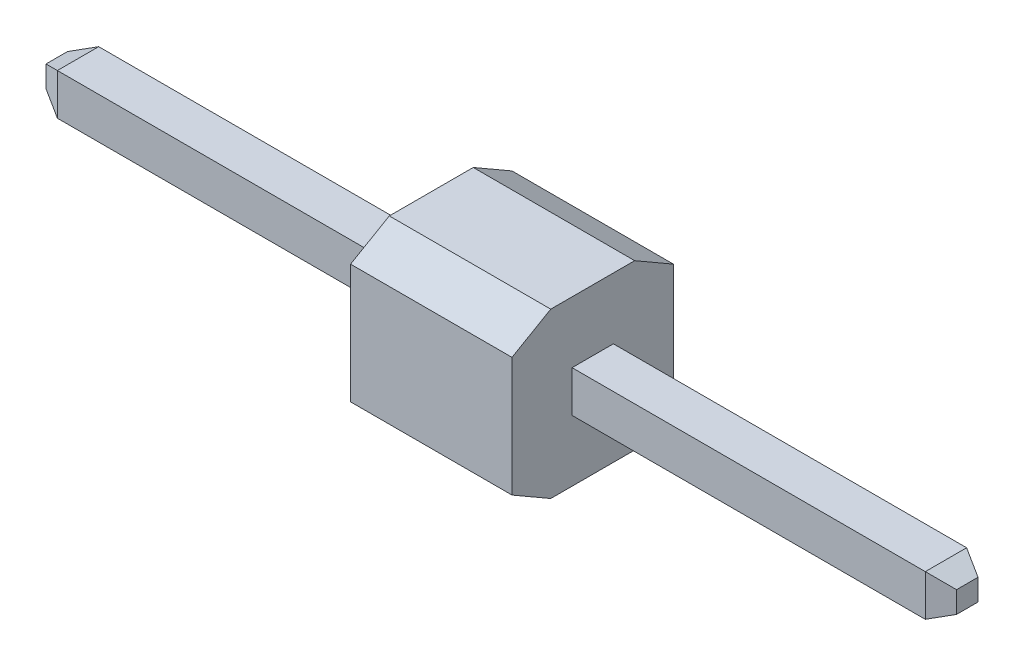
ISO-10303-21;
HEADER;
FILE_DESCRIPTION(('STEP AP214'),'2;1');
FILE_NAME('part.step','',(''),(''),'','','');
FILE_SCHEMA(('AUTOMOTIVE_DESIGN { 1 0 10303 214 1 1 1 1 }'));
ENDSEC;
DATA;
#1=APPLICATION_CONTEXT('core data for automotive mechanical design processes');
#2=APPLICATION_PROTOCOL_DEFINITION('international standard','automotive_design',2000,#1);
#3=PRODUCT_CONTEXT('',#1,'mechanical');
#4=PRODUCT('Part','Part','',(#3));
#5=PRODUCT_RELATED_PRODUCT_CATEGORY('part','',(#4));
#6=PRODUCT_DEFINITION_FORMATION('','',#4);
#7=PRODUCT_DEFINITION_CONTEXT('part definition',#1,'design');
#8=PRODUCT_DEFINITION('design','',#6,#7);
#9=PRODUCT_DEFINITION_SHAPE('','',#8);
#10=(LENGTH_UNIT() NAMED_UNIT(*) SI_UNIT(.MILLI.,.METRE.));
#11=(NAMED_UNIT(*) PLANE_ANGLE_UNIT() SI_UNIT($,.RADIAN.));
#12=(NAMED_UNIT(*) SI_UNIT($,.STERADIAN.) SOLID_ANGLE_UNIT());
#13=UNCERTAINTY_MEASURE_WITH_UNIT(LENGTH_MEASURE(1.E-05),#10,'distance_accuracy_value','');
#14=(GEOMETRIC_REPRESENTATION_CONTEXT(3) GLOBAL_UNCERTAINTY_ASSIGNED_CONTEXT((#13)) GLOBAL_UNIT_ASSIGNED_CONTEXT((#10,
#11,#12)) REPRESENTATION_CONTEXT('',''));
#15=CARTESIAN_POINT('',(0.,0.,0.));
#16=DIRECTION('',(0.,0.,1.));
#17=DIRECTION('',(1.,0.,0.));
#18=AXIS2_PLACEMENT_3D('',#15,#16,#17);
#19=CARTESIAN_POINT('',(5.42109969062971,-7.30288427394286,-2.77111992940321));
#20=DIRECTION('',(1.,-9.93476518829084E-08,4.37113882867379E-08));
#21=DIRECTION('',(-9.93476589883358E-08,-1.,8.74227765734759E-08));
#22=AXIS2_PLACEMENT_3D('',#19,#20,#21);
#23=PLANE('',#22);
#24=DIRECTION('',(-1.18186619959243E-08,-0.500000075710538,-0.866025360072935));
#25=VECTOR('',#24,1.);
#26=CARTESIAN_POINT('',(5.4210994984551,-8.54647397517509,-1.20111982068513));
#27=LINE('',#26,#25);
#28=CARTESIAN_POINT('',(5.4210994984551,-8.54647397517509,-1.20111982068513));
#29=VERTEX_POINT('',#28);
#30=CARTESIAN_POINT('',(5.42109949026689,-8.89288418914276,-1.80111979040099));
#31=VERTEX_POINT('',#30);
#32=EDGE_CURVE('E11',#29,#31,#27,.T.);
#33=ORIENTED_EDGE('',*,*,#32,.T.);
#34=DIRECTION('',(4.37113811813104E-08,-8.74227842254741E-08,-0.999999999999995));
#35=VECTOR('',#34,1.);
#36=CARTESIAN_POINT('',(5.42109949026689,-8.89288418914276,-1.80111979040099));
#37=LINE('',#36,#35);
#38=CARTESIAN_POINT('',(5.42109954709169,-8.89288430279238,-3.10111979040099));
#39=VERTEX_POINT('',#38);
#40=EDGE_CURVE('E304',#31,#39,#37,.T.);
#41=ORIENTED_EDGE('',*,*,#40,.T.);
#42=DIRECTION('',(8.75289950709516E-08,0.499999924289837,-0.866025447495713));
#43=VECTOR('',#42,1.);
#44=CARTESIAN_POINT('',(5.42109954709169,-8.89288430279238,-3.10111979040099));
#45=LINE('',#44,#43);
#46=CARTESIAN_POINT('',(5.42109960773356,-8.54647419373205,-3.70111982068513));
#47=VERTEX_POINT('',#46);
#48=EDGE_CURVE('E296',#39,#47,#45,.T.);
#49=ORIENTED_EDGE('',*,*,#48,.T.);
#50=DIRECTION('',(9.93476593243697E-08,0.999999999999991,-8.74227764821842E-08));
#51=VECTOR('',#50,1.);
#52=CARTESIAN_POINT('',(5.42109960773356,-8.54647419373205,-3.70111982068513));
#53=LINE('',#52,#51);
#54=CARTESIAN_POINT('',(5.42109979124653,-6.69929451676005,-3.70111998217071));
#55=VERTEX_POINT('',#54);
#56=EDGE_CURVE('E281',#47,#55,#53,.T.);
#57=ORIENTED_EDGE('',*,*,#56,.T.);
#58=DIRECTION('',(-1.18186632778994E-08,-0.500000075710539,-0.866025360072934));
#59=VECTOR('',#58,1.);
#60=CARTESIAN_POINT('',(5.42109979943474,-6.35288430279238,-3.10112001245485));
#61=LINE('',#60,#59);
#62=CARTESIAN_POINT('',(5.42109979943474,-6.35288430279238,-3.10112001245485));
#63=VERTEX_POINT('',#62);
#64=EDGE_CURVE('E265',#63,#55,#61,.T.);
#65=ORIENTED_EDGE('',*,*,#64,.F.);
#66=DIRECTION('',(4.37113811813104E-08,-8.74227835422599E-08,-0.999999999999995));
#67=VECTOR('',#66,1.);
#68=CARTESIAN_POINT('',(5.42109974260995,-6.35288418914276,-1.80112001245485));
#69=LINE('',#68,#67);
#70=CARTESIAN_POINT('',(5.42109974260995,-6.35288418914276,-1.80112001245485));
#71=VERTEX_POINT('',#70);
#72=EDGE_CURVE('E248',#71,#63,#69,.T.);
#73=ORIENTED_EDGE('',*,*,#72,.F.);
#74=DIRECTION('',(8.75289963529268E-08,0.499999924289837,-0.866025447495713));
#75=VECTOR('',#74,1.);
#76=CARTESIAN_POINT('',(5.42109968196808,-6.69929429820309,-1.20111998217071));
#77=LINE('',#76,#75);
#78=CARTESIAN_POINT('',(5.42109968196808,-6.69929429820309,-1.20111998217071));
#79=VERTEX_POINT('',#78);
#80=EDGE_CURVE('E242',#79,#71,#77,.T.);
#81=ORIENTED_EDGE('',*,*,#80,.F.);
#82=DIRECTION('',(9.93476593243697E-08,0.999999999999991,-8.74227763619768E-08));
#83=VECTOR('',#82,1.);
#84=CARTESIAN_POINT('',(5.4210994984551,-8.54647397517509,-1.20111982068513));
#85=LINE('',#84,#83);
#86=EDGE_CURVE('E236',#29,#79,#85,.T.);
#87=ORIENTED_EDGE('',*,*,#86,.F.);
#88=EDGE_LOOP('',(#33,#41,#49,#57,#65,#73,#81,#87));
#89=FACE_BOUND('',#88,.T.);
#90=DIRECTION('',(-4.37113817364219E-08,8.74227842895255E-08,0.999999999999995));
#91=VECTOR('',#90,1.);
#92=CARTESIAN_POINT('',(5.42109962704721,-7.94288427394286,-2.77111987345263));
#93=LINE('',#92,#91);
#94=CARTESIAN_POINT('',(5.42109962704721,-7.94288427394286,-2.77111987345263));
#95=VERTEX_POINT('',#94);
#96=CARTESIAN_POINT('',(5.42109959907193,-7.94288421799228,-2.13111987345263));
#97=VERTEX_POINT('',#96);
#98=EDGE_CURVE('E302',#95,#97,#93,.T.);
#99=ORIENTED_EDGE('',*,*,#98,.T.);
#100=DIRECTION('',(-9.93476592658907E-08,-0.999999999999991,8.74227759628525E-08));
#101=VECTOR('',#100,1.);
#102=CARTESIAN_POINT('',(5.42109966265443,-7.30288421799228,-2.13111992940321));
#103=LINE('',#102,#101);
#104=CARTESIAN_POINT('',(5.42109966265443,-7.30288421799228,-2.13111992940321));
#105=VERTEX_POINT('',#104);
#106=EDGE_CURVE('E293',#105,#97,#103,.T.);
#107=ORIENTED_EDGE('',*,*,#106,.F.);
#108=DIRECTION('',(-4.37113817364219E-08,8.74227842895254E-08,0.999999999999995));
#109=VECTOR('',#108,1.);
#110=CARTESIAN_POINT('',(5.42109969062971,-7.30288427394286,-2.77111992940321));
#111=LINE('',#110,#109);
#112=CARTESIAN_POINT('',(5.42109969062971,-7.30288427394286,-2.77111992940321));
#113=VERTEX_POINT('',#112);
#114=EDGE_CURVE('E278',#113,#105,#111,.T.);
#115=ORIENTED_EDGE('',*,*,#114,.F.);
#116=DIRECTION('',(-9.93476592658907E-08,-0.999999999999991,8.74227766567419E-08));
#117=VECTOR('',#116,1.);
#118=CARTESIAN_POINT('',(5.42109969062971,-7.30288427394286,-2.77111992940321));
#119=LINE('',#118,#117);
#120=EDGE_CURVE('E263',#113,#95,#119,.T.);
#121=ORIENTED_EDGE('',*,*,#120,.T.);
#122=EDGE_LOOP('',(#99,#107,#115,#121));
#123=FACE_BOUND('',#122,.T.);
#124=ADVANCED_FACE('F17',(#89,#123),#23,.T.);
#125=CARTESIAN_POINT('',(2.92109969062971,-7.30288402557373,-2.77112003868168));
#126=DIRECTION('',(1.,-9.93476518829084E-08,4.37113882867379E-08));
#127=DIRECTION('',(-9.93476589883358E-08,-1.,8.74227765734759E-08));
#128=AXIS2_PLACEMENT_3D('',#125,#126,#127);
#129=PLANE('',#128);
#130=DIRECTION('',(-1.18186626369119E-08,-0.500000075710538,-0.866025360072935));
#131=VECTOR('',#130,1.);
#132=CARTESIAN_POINT('',(2.9210994984551,-8.54647372680596,-1.2011199299636));
#133=LINE('',#132,#131);
#134=CARTESIAN_POINT('',(2.9210994984551,-8.54647372680596,-1.2011199299636));
#135=VERTEX_POINT('',#134);
#136=CARTESIAN_POINT('',(2.92109949026689,-8.89288394077363,-1.80111989967946));
#137=VERTEX_POINT('',#136);
#138=EDGE_CURVE('E24',#135,#137,#133,.T.);
#139=ORIENTED_EDGE('',*,*,#138,.F.);
#140=DIRECTION('',(9.9347659083955E-08,0.999999999999991,-8.74227763619768E-08));
#141=VECTOR('',#140,1.);
#142=CARTESIAN_POINT('',(2.9210994984551,-8.54647372680596,-1.2011199299636));
#143=LINE('',#142,#141);
#144=CARTESIAN_POINT('',(2.92109968196808,-6.69929404983396,-1.20112009144918));
#145=VERTEX_POINT('',#144);
#146=EDGE_CURVE('E300',#135,#145,#143,.T.);
#147=ORIENTED_EDGE('',*,*,#146,.T.);
#148=DIRECTION('',(8.75289963529268E-08,0.499999924289837,-0.866025447495713));
#149=VECTOR('',#148,1.);
#150=CARTESIAN_POINT('',(2.92109968196808,-6.69929404983396,-1.20112009144918));
#151=LINE('',#150,#149);
#152=CARTESIAN_POINT('',(2.92109974260995,-6.35288394077363,-1.80112012173332));
#153=VERTEX_POINT('',#152);
#154=EDGE_CURVE('E286',#145,#153,#151,.T.);
#155=ORIENTED_EDGE('',*,*,#154,.T.);
#156=DIRECTION('',(4.37113811813104E-08,-8.74227835422599E-08,-0.999999999999995));
#157=VECTOR('',#156,1.);
#158=CARTESIAN_POINT('',(2.92109974260995,-6.35288394077363,-1.80112012173332));
#159=LINE('',#158,#157);
#160=CARTESIAN_POINT('',(2.92109979943474,-6.35288405442325,-3.10112012173332));
#161=VERTEX_POINT('',#160);
#162=EDGE_CURVE('E271',#153,#161,#159,.T.);
#163=ORIENTED_EDGE('',*,*,#162,.T.);
#164=DIRECTION('',(-1.18186632778994E-08,-0.500000075710539,-0.866025360072934));
#165=VECTOR('',#164,1.);
#166=CARTESIAN_POINT('',(2.92109979943474,-6.35288405442325,-3.10112012173332));
#167=LINE('',#166,#165);
#168=CARTESIAN_POINT('',(2.92109979124653,-6.69929426839092,-3.70112009144918));
#169=VERTEX_POINT('',#168);
#170=EDGE_CURVE('E253',#161,#169,#167,.T.);
#171=ORIENTED_EDGE('',*,*,#170,.T.);
#172=DIRECTION('',(9.9347659083955E-08,0.999999999999991,-8.74227764821842E-08));
#173=VECTOR('',#172,1.);
#174=CARTESIAN_POINT('',(2.92109960773356,-8.54647394536292,-3.7011199299636));
#175=LINE('',#174,#173);
#176=CARTESIAN_POINT('',(2.92109960773356,-8.54647394536292,-3.7011199299636));
#177=VERTEX_POINT('',#176);
#178=EDGE_CURVE('E261',#177,#169,#175,.T.);
#179=ORIENTED_EDGE('',*,*,#178,.F.);
#180=DIRECTION('',(8.75289957119392E-08,0.499999924289837,-0.866025447495713));
#181=VECTOR('',#180,1.);
#182=CARTESIAN_POINT('',(2.92109954709169,-8.89288405442325,-3.10111989967946));
#183=LINE('',#182,#181);
#184=CARTESIAN_POINT('',(2.92109954709169,-8.89288405442325,-3.10111989967946));
#185=VERTEX_POINT('',#184);
#186=EDGE_CURVE('E276',#185,#177,#183,.T.);
#187=ORIENTED_EDGE('',*,*,#186,.F.);
#188=DIRECTION('',(4.37113811813104E-08,-8.74227842254741E-08,-0.999999999999995));
#189=VECTOR('',#188,1.);
#190=CARTESIAN_POINT('',(2.92109949026689,-8.89288394077363,-1.80111989967946));
#191=LINE('',#190,#189);
#192=EDGE_CURVE('E291',#137,#185,#191,.T.);
#193=ORIENTED_EDGE('',*,*,#192,.F.);
#194=EDGE_LOOP('',(#139,#147,#155,#163,#171,#179,#187,#193));
#195=FACE_BOUND('',#194,.T.);
#196=DIRECTION('',(-9.93476592658907E-08,-0.999999999999991,8.74227759628525E-08));
#197=VECTOR('',#196,1.);
#198=CARTESIAN_POINT('',(2.92109966265443,-7.30288396962315,-2.13112003868168));
#199=LINE('',#198,#197);
#200=CARTESIAN_POINT('',(2.92109966265443,-7.30288396962315,-2.13112003868168));
#201=VERTEX_POINT('',#200);
#202=CARTESIAN_POINT('',(2.92109959907193,-7.94288396962315,-2.1311199827311));
#203=VERTEX_POINT('',#202);
#204=EDGE_CURVE('E298',#201,#203,#199,.T.);
#205=ORIENTED_EDGE('',*,*,#204,.T.);
#206=DIRECTION('',(-4.37113817364219E-08,8.74227842895255E-08,0.999999999999995));
#207=VECTOR('',#206,1.);
#208=CARTESIAN_POINT('',(2.92109962704721,-7.94288402557373,-2.7711199827311));
#209=LINE('',#208,#207);
#210=CARTESIAN_POINT('',(2.92109962704721,-7.94288402557373,-2.7711199827311));
#211=VERTEX_POINT('',#210);
#212=EDGE_CURVE('E283',#211,#203,#209,.T.);
#213=ORIENTED_EDGE('',*,*,#212,.F.);
#214=DIRECTION('',(-9.93476585720013E-08,-0.999999999999991,8.74227766567419E-08));
#215=VECTOR('',#214,1.);
#216=CARTESIAN_POINT('',(2.92109969062971,-7.30288402557373,-2.77112003868168));
#217=LINE('',#216,#215);
#218=CARTESIAN_POINT('',(2.92109969062971,-7.30288402557373,-2.77112003868168));
#219=VERTEX_POINT('',#218);
#220=EDGE_CURVE('E268',#219,#211,#217,.T.);
#221=ORIENTED_EDGE('',*,*,#220,.F.);
#222=DIRECTION('',(-4.37113810425325E-08,8.74227842895254E-08,0.999999999999995));
#223=VECTOR('',#222,1.);
#224=CARTESIAN_POINT('',(2.92109969062971,-7.30288402557373,-2.77112003868168));
#225=LINE('',#224,#223);
#226=EDGE_CURVE('E251',#219,#201,#225,.T.);
#227=ORIENTED_EDGE('',*,*,#226,.T.);
#228=EDGE_LOOP('',(#205,#213,#221,#227));
#229=FACE_BOUND('',#228,.T.);
#230=ADVANCED_FACE('F314',(#195,#229),#129,.F.);
#231=CARTESIAN_POINT('',(5.4210994984551,-8.54647397517509,-1.20111982068513));
#232=DIRECTION('',(1.07893287081065E-07,0.866025360072937,-0.500000075710535));
#233=DIRECTION('',(1.18186629566715E-08,0.500000075710542,0.866025360072941));
#234=AXIS2_PLACEMENT_3D('',#231,#232,#233);
#235=PLANE('',#234);
#236=ORIENTED_EDGE('',*,*,#138,.T.);
#237=DIRECTION('',(-0.999999999999994,9.93476518829078E-08,-4.37113883755555E-08));
#238=VECTOR('',#237,1.);
#239=CARTESIAN_POINT('',(5.42109949026689,-8.89288418914276,-1.80111979040099));
#240=LINE('',#239,#238);
#241=EDGE_CURVE('E288',#31,#137,#240,.T.);
#242=ORIENTED_EDGE('',*,*,#241,.F.);
#243=ORIENTED_EDGE('',*,*,#32,.F.);
#244=DIRECTION('',(-0.999999999999994,9.93476518829078E-08,-4.3711388109102E-08));
#245=VECTOR('',#244,1.);
#246=CARTESIAN_POINT('',(5.4210994984551,-8.54647397517509,-1.20111982068513));
#247=LINE('',#246,#245);
#248=EDGE_CURVE('E256',#29,#135,#247,.T.);
#249=ORIENTED_EDGE('',*,*,#248,.T.);
#250=EDGE_LOOP('',(#236,#242,#243,#249));
#251=FACE_BOUND('',#250,.T.);
#252=ADVANCED_FACE('F306',(#251),#235,.F.);
#253=CARTESIAN_POINT('',(5.42109949026689,-8.89288418914276,-1.80111979040099));
#254=DIRECTION('',(9.93476589883358E-08,1.,-8.74227765734759E-08));
#255=DIRECTION('',(1.,-9.93476518829084E-08,4.37113882867379E-08));
#256=AXIS2_PLACEMENT_3D('',#253,#254,#255);
#257=PLANE('',#256);
#258=ORIENTED_EDGE('',*,*,#192,.T.);
#259=DIRECTION('',(-0.999999999999994,9.93476518829078E-08,-4.37113882867377E-08));
#260=VECTOR('',#259,1.);
#261=CARTESIAN_POINT('',(5.42109954709169,-8.89288430279238,-3.10111979040099));
#262=LINE('',#261,#260);
#263=EDGE_CURVE('E273',#39,#185,#262,.T.);
#264=ORIENTED_EDGE('',*,*,#263,.F.);
#265=ORIENTED_EDGE('',*,*,#40,.F.);
#266=ORIENTED_EDGE('',*,*,#241,.T.);
#267=EDGE_LOOP('',(#258,#264,#265,#266));
#268=FACE_BOUND('',#267,.T.);
#269=ADVANCED_FACE('F311',(#268),#257,.F.);
#270=CARTESIAN_POINT('',(5.42109954709169,-8.89288430279238,-3.10111979040099));
#271=DIRECTION('',(6.41819058997377E-08,0.866025447495721,0.499999924289845));
#272=DIRECTION('',(-8.7528996031702E-08,-0.499999924289838,0.866025447495717));
#273=AXIS2_PLACEMENT_3D('',#270,#271,#272);
#274=PLANE('',#273);
#275=ORIENTED_EDGE('',*,*,#186,.T.);
#276=DIRECTION('',(-0.999999999999994,9.93476518829078E-08,-4.37113882867377E-08));
#277=VECTOR('',#276,1.);
#278=CARTESIAN_POINT('',(5.42109960773356,-8.54647419373205,-3.70111982068513));
#279=LINE('',#278,#277);
#280=EDGE_CURVE('E258',#47,#177,#279,.T.);
#281=ORIENTED_EDGE('',*,*,#280,.F.);
#282=ORIENTED_EDGE('',*,*,#48,.F.);
#283=ORIENTED_EDGE('',*,*,#263,.T.);
#284=EDGE_LOOP('',(#275,#281,#282,#283));
#285=FACE_BOUND('',#284,.T.);
#286=ADVANCED_FACE('F319',(#285),#274,.F.);
#287=CARTESIAN_POINT('',(5.42109960773356,-8.54647419373205,-3.70111982068513));
#288=DIRECTION('',(-4.37113811813106E-08,8.74227836789032E-08,1.));
#289=DIRECTION('',(-1.,9.93476518829084E-08,-4.37113882867379E-08));
#290=AXIS2_PLACEMENT_3D('',#287,#288,#289);
#291=PLANE('',#290);
#292=ORIENTED_EDGE('',*,*,#178,.T.);
#293=DIRECTION('',(-0.999999999999994,9.93476518829078E-08,-4.37113882867377E-08));
#294=VECTOR('',#293,1.);
#295=CARTESIAN_POINT('',(5.42109979124653,-6.69929451676005,-3.70111998217071));
#296=LINE('',#295,#294);
#297=EDGE_CURVE('E245',#55,#169,#296,.T.);
#298=ORIENTED_EDGE('',*,*,#297,.F.);
#299=ORIENTED_EDGE('',*,*,#56,.F.);
#300=ORIENTED_EDGE('',*,*,#280,.T.);
#301=EDGE_LOOP('',(#292,#298,#299,#300));
#302=FACE_BOUND('',#301,.T.);
#303=ADVANCED_FACE('F326',(#302),#291,.F.);
#304=CARTESIAN_POINT('',(5.42109979943474,-6.35288430279238,-3.10112001245485));
#305=DIRECTION('',(1.07893287081065E-07,0.866025360072937,-0.500000075710535));
#306=DIRECTION('',(1.18186629566715E-08,0.500000075710542,0.866025360072941));
#307=AXIS2_PLACEMENT_3D('',#304,#305,#306);
#308=PLANE('',#307);
#309=ORIENTED_EDGE('',*,*,#170,.F.);
#310=DIRECTION('',(-0.999999999999994,9.93476522381792E-08,-4.37113882867377E-08));
#311=VECTOR('',#310,1.);
#312=CARTESIAN_POINT('',(5.42109979943474,-6.35288430279238,-3.10112001245485));
#313=LINE('',#312,#311);
#314=EDGE_CURVE('E239',#63,#161,#313,.T.);
#315=ORIENTED_EDGE('',*,*,#314,.F.);
#316=ORIENTED_EDGE('',*,*,#64,.T.);
#317=ORIENTED_EDGE('',*,*,#297,.T.);
#318=EDGE_LOOP('',(#309,#315,#316,#317));
#319=FACE_BOUND('',#318,.T.);
#320=ADVANCED_FACE('F329',(#319),#308,.T.);
#321=CARTESIAN_POINT('',(5.42109974260995,-6.35288418914276,-1.80112001245485));
#322=DIRECTION('',(9.93476589883358E-08,1.,-8.74227765734759E-08));
#323=DIRECTION('',(1.,-9.93476518829084E-08,4.37113882867379E-08));
#324=AXIS2_PLACEMENT_3D('',#321,#322,#323);
#325=PLANE('',#324);
#326=ORIENTED_EDGE('',*,*,#162,.F.);
#327=DIRECTION('',(-0.999999999999994,9.93476522381792E-08,-4.37113884643734E-08));
#328=VECTOR('',#327,1.);
#329=CARTESIAN_POINT('',(5.42109974260995,-6.35288418914276,-1.80112001245485));
#330=LINE('',#329,#328);
#331=EDGE_CURVE('E233',#71,#153,#330,.T.);
#332=ORIENTED_EDGE('',*,*,#331,.F.);
#333=ORIENTED_EDGE('',*,*,#72,.T.);
#334=ORIENTED_EDGE('',*,*,#314,.T.);
#335=EDGE_LOOP('',(#326,#332,#333,#334));
#336=FACE_BOUND('',#335,.T.);
#337=ADVANCED_FACE('F333',(#336),#325,.T.);
#338=CARTESIAN_POINT('',(5.42109968196808,-6.69929429820309,-1.20111998217071));
#339=DIRECTION('',(6.41819058997377E-08,0.866025447495721,0.499999924289845));
#340=DIRECTION('',(-8.7528996031702E-08,-0.499999924289838,0.866025447495717));
#341=AXIS2_PLACEMENT_3D('',#338,#339,#340);
#342=PLANE('',#341);
#343=ORIENTED_EDGE('',*,*,#154,.F.);
#344=DIRECTION('',(-0.999999999999994,9.93476518829078E-08,-4.3711388109102E-08));
#345=VECTOR('',#344,1.);
#346=CARTESIAN_POINT('',(5.42109968196808,-6.69929429820309,-1.20111998217071));
#347=LINE('',#346,#345);
#348=EDGE_CURVE('E230',#79,#145,#347,.T.);
#349=ORIENTED_EDGE('',*,*,#348,.F.);
#350=ORIENTED_EDGE('',*,*,#80,.T.);
#351=ORIENTED_EDGE('',*,*,#331,.T.);
#352=EDGE_LOOP('',(#343,#349,#350,#351));
#353=FACE_BOUND('',#352,.T.);
#354=ADVANCED_FACE('F337',(#353),#342,.T.);
#355=CARTESIAN_POINT('',(5.4210994984551,-8.54647397517509,-1.20111982068513));
#356=DIRECTION('',(-4.37113811813106E-08,8.74227835615132E-08,1.));
#357=DIRECTION('',(-9.93476589883358E-08,-1.,8.74227764560859E-08));
#358=AXIS2_PLACEMENT_3D('',#355,#356,#357);
#359=PLANE('',#358);
#360=ORIENTED_EDGE('',*,*,#146,.F.);
#361=ORIENTED_EDGE('',*,*,#248,.F.);
#362=ORIENTED_EDGE('',*,*,#86,.T.);
#363=ORIENTED_EDGE('',*,*,#348,.T.);
#364=EDGE_LOOP('',(#360,#361,#362,#363));
#365=FACE_BOUND('',#364,.T.);
#366=ADVANCED_FACE('F339',(#365),#359,.T.);
#367=CARTESIAN_POINT('',(-2.87890030937029,-7.30288344935735,-2.77112029220773));
#368=DIRECTION('',(-1.,9.93476518829084E-08,-4.37113882867379E-08));
#369=DIRECTION('',(9.93476589883358E-08,1.,-8.74227765734759E-08));
#370=AXIS2_PLACEMENT_3D('',#367,#368,#369);
#371=PLANE('',#370);
#372=DIRECTION('',(9.93476581453995E-08,0.999999999999991,-8.74227774760709E-08));
#373=VECTOR('',#372,1.);
#374=CARTESIAN_POINT('',(-2.87890037891393,-7.78900187966852,-2.2850017769009));
#375=LINE('',#374,#373);
#376=CARTESIAN_POINT('',(-2.87890037891393,-7.78900187966852,-2.2850017769009));
#377=VERTEX_POINT('',#376);
#378=CARTESIAN_POINT('',(-2.87890034590697,-7.45676493405052,-2.28500180594598));
#379=VERTEX_POINT('',#378);
#380=EDGE_CURVE('E228',#377,#379,#375,.T.);
#381=ORIENTED_EDGE('',*,*,#380,.T.);
#382=DIRECTION('',(4.37113793813867E-08,-8.74227801493995E-08,-0.999999999999995));
#383=VECTOR('',#382,1.);
#384=CARTESIAN_POINT('',(-2.87890034590697,-7.45676493405052,-2.28500180594598));
#385=LINE('',#384,#383);
#386=CARTESIAN_POINT('',(-2.87890033138443,-7.4567649630956,-2.61723875156398));
#387=VERTEX_POINT('',#386);
#388=EDGE_CURVE('E223',#379,#387,#385,.T.);
#389=ORIENTED_EDGE('',*,*,#388,.T.);
#390=DIRECTION('',(-9.93476608187277E-08,-0.999999999999991,8.74227761394067E-08));
#391=VECTOR('',#390,1.);
#392=CARTESIAN_POINT('',(-2.87890033138443,-7.4567649630956,-2.61723875156398));
#393=LINE('',#392,#391);
#394=CARTESIAN_POINT('',(-2.8789003643914,-7.7890019087136,-2.6172387225189));
#395=VERTEX_POINT('',#394);
#396=EDGE_CURVE('E215',#387,#395,#393,.T.);
#397=ORIENTED_EDGE('',*,*,#396,.T.);
#398=DIRECTION('',(-4.37113767080584E-08,8.74227828227278E-08,0.999999999999995));
#399=VECTOR('',#398,1.);
#400=CARTESIAN_POINT('',(-2.8789003643914,-7.7890019087136,-2.6172387225189));
#401=LINE('',#400,#399);
#402=EDGE_CURVE('E207',#395,#377,#401,.T.);
#403=ORIENTED_EDGE('',*,*,#402,.T.);
#404=EDGE_LOOP('',(#381,#389,#397,#403));
#405=FACE_BOUND('',#404,.T.);
#406=ADVANCED_FACE('F341',(#405),#371,.T.);
#407=CARTESIAN_POINT('',(-2.87890030937029,-7.30288344935735,-2.77112029220773));
#408=DIRECTION('',(9.93476589883358E-08,1.,-8.74227764510112E-08));
#409=DIRECTION('',(-4.37113811813106E-08,8.74227835564385E-08,1.));
#410=AXIS2_PLACEMENT_3D('',#407,#408,#409);
#411=PLANE('',#410);
#412=DIRECTION('',(0.999999999999994,-9.93476522661073E-08,4.37113882769953E-08));
#413=VECTOR('',#412,1.);
#414=CARTESIAN_POINT('',(-2.54890030937029,-7.30288348214207,-2.77112027778297));
#415=LINE('',#414,#413);
#416=CARTESIAN_POINT('',(-2.54890030937029,-7.30288348214207,-2.77112027778297));
#417=VERTEX_POINT('',#416);
#418=EDGE_CURVE('E225',#417,#219,#415,.T.);
#419=ORIENTED_EDGE('',*,*,#418,.F.);
#420=DIRECTION('',(-4.37113817364219E-08,8.74227842895255E-08,0.999999999999995));
#421=VECTOR('',#420,1.);
#422=CARTESIAN_POINT('',(-2.54890030937029,-7.30288348214207,-2.77112027778297));
#423=LINE('',#422,#421);
#424=CARTESIAN_POINT('',(-2.54890033734557,-7.30288342619149,-2.13112027778297));
#425=VERTEX_POINT('',#424);
#426=EDGE_CURVE('E217',#417,#425,#423,.T.);
#427=ORIENTED_EDGE('',*,*,#426,.T.);
#428=DIRECTION('',(0.999999999999994,-9.93476522661073E-08,4.37113882769953E-08));
#429=VECTOR('',#428,1.);
#430=CARTESIAN_POINT('',(-2.54890033734557,-7.30288342619149,-2.13112027778297));
#431=LINE('',#430,#429);
#432=EDGE_CURVE('E220',#425,#201,#431,.T.);
#433=ORIENTED_EDGE('',*,*,#432,.T.);
#434=ORIENTED_EDGE('',*,*,#226,.F.);
#435=EDGE_LOOP('',(#419,#427,#433,#434));
#436=FACE_BOUND('',#435,.T.);
#437=ADVANCED_FACE('F348',(#436),#411,.T.);
#438=CARTESIAN_POINT('',(-2.87890033734557,-7.30288339340677,-2.13112029220773));
#439=DIRECTION('',(-4.37113811813106E-08,8.74227836789032E-08,1.));
#440=DIRECTION('',(-1.,9.93476518829084E-08,-4.37113882867379E-08));
#441=AXIS2_PLACEMENT_3D('',#438,#439,#440);
#442=PLANE('',#441);
#443=ORIENTED_EDGE('',*,*,#432,.F.);
#444=DIRECTION('',(-9.93476592658907E-08,-0.999999999999991,8.74227766567419E-08));
#445=VECTOR('',#444,1.);
#446=CARTESIAN_POINT('',(-2.54890033734557,-7.30288342619149,-2.13112027778297));
#447=LINE('',#446,#445);
#448=CARTESIAN_POINT('',(-2.54890040092807,-7.94288342619149,-2.1311202218324));
#449=VERTEX_POINT('',#448);
#450=EDGE_CURVE('E209',#425,#449,#447,.T.);
#451=ORIENTED_EDGE('',*,*,#450,.T.);
#452=DIRECTION('',(0.999999999999994,-9.93476517789893E-08,4.37113882769953E-08));
#453=VECTOR('',#452,1.);
#454=CARTESIAN_POINT('',(-2.54890040092807,-7.94288342619149,-2.1311202218324));
#455=LINE('',#454,#453);
#456=EDGE_CURVE('E212',#449,#203,#455,.T.);
#457=ORIENTED_EDGE('',*,*,#456,.T.);
#458=ORIENTED_EDGE('',*,*,#204,.F.);
#459=EDGE_LOOP('',(#443,#451,#457,#458));
#460=FACE_BOUND('',#459,.T.);
#461=ADVANCED_FACE('F424',(#460),#442,.T.);
#462=CARTESIAN_POINT('',(-2.87890037295279,-7.94288344935735,-2.77112023625715));
#463=DIRECTION('',(9.93476589883357E-08,1.,-8.74227764040693E-08));
#464=DIRECTION('',(-4.37113811813106E-08,8.74227835094966E-08,1.));
#465=AXIS2_PLACEMENT_3D('',#462,#463,#464);
#466=PLANE('',#465);
#467=ORIENTED_EDGE('',*,*,#456,.F.);
#468=DIRECTION('',(4.37113831242006E-08,-8.74227856773042E-08,-0.999999999999995));
#469=VECTOR('',#468,1.);
#470=CARTESIAN_POINT('',(-2.54890040092808,-7.94288342619149,-2.1311202218324));
#471=LINE('',#470,#469);
#472=CARTESIAN_POINT('',(-2.54890037295279,-7.94288348214207,-2.7711202218324));
#473=VERTEX_POINT('',#472);
#474=EDGE_CURVE('E201',#449,#473,#471,.T.);
#475=ORIENTED_EDGE('',*,*,#474,.T.);
#476=DIRECTION('',(0.999999999999994,-9.93476517789893E-08,4.37113883581816E-08));
#477=VECTOR('',#476,1.);
#478=CARTESIAN_POINT('',(-2.54890037295279,-7.94288348214207,-2.7711202218324));
#479=LINE('',#478,#477);
#480=EDGE_CURVE('E204',#473,#211,#479,.T.);
#481=ORIENTED_EDGE('',*,*,#480,.T.);
#482=ORIENTED_EDGE('',*,*,#212,.T.);
#483=EDGE_LOOP('',(#467,#475,#481,#482));
#484=FACE_BOUND('',#483,.T.);
#485=ADVANCED_FACE('F421',(#484),#466,.F.);
#486=CARTESIAN_POINT('',(-2.87890030937029,-7.30288344935735,-2.77112029220773));
#487=DIRECTION('',(-4.37113811813106E-08,8.74227836789032E-08,1.));
#488=DIRECTION('',(-1.,9.93476518829084E-08,-4.37113882867379E-08));
#489=AXIS2_PLACEMENT_3D('',#486,#487,#488);
#490=PLANE('',#489);
#491=ORIENTED_EDGE('',*,*,#480,.F.);
#492=DIRECTION('',(9.93476578781121E-08,0.999999999999991,-8.74227759628526E-08));
#493=VECTOR('',#492,1.);
#494=CARTESIAN_POINT('',(-2.54890037295279,-7.94288348214207,-2.7711202218324));
#495=LINE('',#494,#493);
#496=EDGE_CURVE('E196',#473,#417,#495,.T.);
#497=ORIENTED_EDGE('',*,*,#496,.T.);
#498=ORIENTED_EDGE('',*,*,#418,.T.);
#499=ORIENTED_EDGE('',*,*,#220,.T.);
#500=EDGE_LOOP('',(#491,#497,#498,#499));
#501=FACE_BOUND('',#500,.T.);
#502=ADVANCED_FACE('F376',(#501),#490,.F.);
#503=CARTESIAN_POINT('',(-2.87890030937029,-7.30288344935735,-2.77112029220773));
#504=DIRECTION('',(-4.37113811813106E-08,8.74227836789032E-08,1.));
#505=DIRECTION('',(-1.,9.93476518829084E-08,-4.37113882867379E-08));
#506=AXIS2_PLACEMENT_3D('',#503,#504,#505);
#507=PLANE('',#506);
#508=DIRECTION('',(0.999999999999994,-9.9347651941362E-08,4.37113882769953E-08));
#509=VECTOR('',#508,1.);
#510=CARTESIAN_POINT('',(5.42109969062971,-7.30288427394286,-2.77111992940321));
#511=LINE('',#510,#509);
#512=CARTESIAN_POINT('',(10.8910996906297,-7.30288481737452,-2.77111969030191));
#513=VERTEX_POINT('',#512);
#514=EDGE_CURVE('E199',#113,#513,#511,.T.);
#515=ORIENTED_EDGE('',*,*,#514,.T.);
#516=DIRECTION('',(-9.9347663429227E-08,-0.999999999999991,8.74227766567419E-08));
#517=VECTOR('',#516,1.);
#518=CARTESIAN_POINT('',(10.8910996906297,-7.30288481737452,-2.77111969030191));
#519=LINE('',#518,#517);
#520=CARTESIAN_POINT('',(10.8910996270472,-7.94288481737452,-2.77111963435134));
#521=VERTEX_POINT('',#520);
#522=EDGE_CURVE('E191',#513,#521,#519,.T.);
#523=ORIENTED_EDGE('',*,*,#522,.T.);
#524=DIRECTION('',(0.999999999999994,-9.9347651941362E-08,4.37113882769953E-08));
#525=VECTOR('',#524,1.);
#526=CARTESIAN_POINT('',(5.42109962704721,-7.94288427394286,-2.77111987345263));
#527=LINE('',#526,#525);
#528=EDGE_CURVE('E194',#95,#521,#527,.T.);
#529=ORIENTED_EDGE('',*,*,#528,.F.);
#530=ORIENTED_EDGE('',*,*,#120,.F.);
#531=EDGE_LOOP('',(#515,#523,#529,#530));
#532=FACE_BOUND('',#531,.T.);
#533=ADVANCED_FACE('F367',(#532),#507,.F.);
#534=CARTESIAN_POINT('',(-2.87890037295279,-7.94288344935735,-2.77112023625715));
#535=DIRECTION('',(9.93476589883357E-08,1.,-8.74227764040693E-08));
#536=DIRECTION('',(-4.37113811813106E-08,8.74227835094966E-08,1.));
#537=AXIS2_PLACEMENT_3D('',#534,#535,#536);
#538=PLANE('',#537);
#539=ORIENTED_EDGE('',*,*,#528,.T.);
#540=DIRECTION('',(-4.37113817364219E-08,8.74227842895255E-08,0.999999999999995));
#541=VECTOR('',#540,1.);
#542=CARTESIAN_POINT('',(10.8910996270472,-7.94288481737452,-2.77111963435134));
#543=LINE('',#542,#541);
#544=CARTESIAN_POINT('',(10.8910995990719,-7.94288476142393,-2.13111963435134));
#545=VERTEX_POINT('',#544);
#546=EDGE_CURVE('E186',#521,#545,#543,.T.);
#547=ORIENTED_EDGE('',*,*,#546,.T.);
#548=DIRECTION('',(0.999999999999994,-9.9347651941362E-08,4.37113880334363E-08));
#549=VECTOR('',#548,1.);
#550=CARTESIAN_POINT('',(5.42109959907193,-7.94288421799228,-2.13111987345263));
#551=LINE('',#550,#549);
#552=EDGE_CURVE('E189',#97,#545,#551,.T.);
#553=ORIENTED_EDGE('',*,*,#552,.F.);
#554=ORIENTED_EDGE('',*,*,#98,.F.);
#555=EDGE_LOOP('',(#539,#547,#553,#554));
#556=FACE_BOUND('',#555,.T.);
#557=ADVANCED_FACE('F364',(#556),#538,.F.);
#558=CARTESIAN_POINT('',(-2.87890033734557,-7.30288339340677,-2.13112029220773));
#559=DIRECTION('',(-4.37113811813106E-08,8.74227836789032E-08,1.));
#560=DIRECTION('',(-1.,9.93476518829084E-08,-4.37113882867379E-08));
#561=AXIS2_PLACEMENT_3D('',#558,#559,#560);
#562=PLANE('',#561);
#563=ORIENTED_EDGE('',*,*,#552,.T.);
#564=DIRECTION('',(9.93476578781121E-08,0.999999999999991,-8.74227773506314E-08));
#565=VECTOR('',#564,1.);
#566=CARTESIAN_POINT('',(10.8910995990719,-7.94288476142393,-2.13111963435134));
#567=LINE('',#566,#565);
#568=CARTESIAN_POINT('',(10.8910996626544,-7.30288476142393,-2.13111969030192));
#569=VERTEX_POINT('',#568);
#570=EDGE_CURVE('E176',#545,#569,#567,.T.);
#571=ORIENTED_EDGE('',*,*,#570,.T.);
#572=DIRECTION('',(0.999999999999994,-9.9347651941362E-08,4.37113881146227E-08));
#573=VECTOR('',#572,1.);
#574=CARTESIAN_POINT('',(5.42109966265443,-7.30288421799228,-2.13111992940321));
#575=LINE('',#574,#573);
#576=EDGE_CURVE('E179',#105,#569,#575,.T.);
#577=ORIENTED_EDGE('',*,*,#576,.F.);
#578=ORIENTED_EDGE('',*,*,#106,.T.);
#579=EDGE_LOOP('',(#563,#571,#577,#578));
#580=FACE_BOUND('',#579,.T.);
#581=ADVANCED_FACE('F366',(#580),#562,.T.);
#582=CARTESIAN_POINT('',(-2.87890030937029,-7.30288344935735,-2.77112029220773));
#583=DIRECTION('',(9.93476589883358E-08,1.,-8.74227764510112E-08));
#584=DIRECTION('',(-4.37113811813106E-08,8.74227835564385E-08,1.));
#585=AXIS2_PLACEMENT_3D('',#582,#583,#584);
#586=PLANE('',#585);
#587=ORIENTED_EDGE('',*,*,#576,.T.);
#588=DIRECTION('',(4.37113817364219E-08,-8.74227842895255E-08,-0.999999999999995));
#589=VECTOR('',#588,1.);
#590=CARTESIAN_POINT('',(10.8910996626544,-7.30288476142393,-2.13111969030192));
#591=LINE('',#590,#589);
#592=EDGE_CURVE('E167',#569,#513,#591,.T.);
#593=ORIENTED_EDGE('',*,*,#592,.T.);
#594=ORIENTED_EDGE('',*,*,#514,.F.);
#595=ORIENTED_EDGE('',*,*,#114,.T.);
#596=EDGE_LOOP('',(#587,#593,#594,#595));
#597=FACE_BOUND('',#596,.T.);
#598=ADVANCED_FACE('F373',(#597),#586,.T.);
#599=CARTESIAN_POINT('',(11.2210996906297,-7.30288485015924,-2.77111967587716));
#600=DIRECTION('',(-1.,9.93476518829084E-08,-4.37113882867379E-08));
#601=DIRECTION('',(9.93476589883358E-08,1.,-8.74227765734759E-08));
#602=AXIS2_PLACEMENT_3D('',#599,#600,#601);
#603=PLANE('',#602);
#604=DIRECTION('',(-9.93476581453995E-08,-0.999999999999991,8.74227761394067E-08));
#605=VECTOR('',#604,1.);
#606=CARTESIAN_POINT('',(11.221099654093,-7.45676633485241,-2.28500118961541));
#607=LINE('',#606,#605);
#608=CARTESIAN_POINT('',(11.221099654093,-7.45676633485241,-2.28500118961541));
#609=VERTEX_POINT('',#608);
#610=CARTESIAN_POINT('',(11.2210996210861,-7.78900328047041,-2.28500116057033));
#611=VERTEX_POINT('',#610);
#612=EDGE_CURVE('E153',#609,#611,#607,.T.);
#613=ORIENTED_EDGE('',*,*,#612,.T.);
#614=DIRECTION('',(4.37113820547149E-08,-8.74227854960561E-08,-0.999999999999995));
#615=VECTOR('',#614,1.);
#616=CARTESIAN_POINT('',(11.2210996210861,-7.78900328047041,-2.28500116057033));
#617=LINE('',#616,#615);
#618=CARTESIAN_POINT('',(11.2210996356086,-7.78900330951549,-2.61723810618833));
#619=VERTEX_POINT('',#618);
#620=EDGE_CURVE('E395',#611,#619,#617,.T.);
#621=ORIENTED_EDGE('',*,*,#620,.T.);
#622=DIRECTION('',(9.93476581453995E-08,0.999999999999991,-8.74227761394067E-08));
#623=VECTOR('',#622,1.);
#624=CARTESIAN_POINT('',(11.2210996356086,-7.78900330951549,-2.61723810618833));
#625=LINE('',#624,#623);
#626=CARTESIAN_POINT('',(11.2210996686156,-7.45676636389749,-2.61723813523341));
#627=VERTEX_POINT('',#626);
#628=EDGE_CURVE('E156',#619,#627,#625,.T.);
#629=ORIENTED_EDGE('',*,*,#628,.T.);
#630=DIRECTION('',(-4.37113874013715E-08,8.74227801493996E-08,0.999999999999995));
#631=VECTOR('',#630,1.);
#632=CARTESIAN_POINT('',(11.2210996686156,-7.45676636389749,-2.61723813523341));
#633=LINE('',#632,#631);
#634=EDGE_CURVE('E149',#627,#609,#633,.T.);
#635=ORIENTED_EDGE('',*,*,#634,.T.);
#636=EDGE_LOOP('',(#613,#621,#629,#635));
#637=FACE_BOUND('',#636,.T.);
#638=ADVANCED_FACE('F151',(#637),#603,.F.);
#639=CARTESIAN_POINT('',(-2.87890035766502,-7.78900192216635,-2.77112024970991));
#640=DIRECTION('',(-0.422618351780369,-0.906307745050466,6.07587120833484E-08));
#641=DIRECTION('',(4.37113811813106E-08,-8.74227835094966E-08,-1.));
#642=AXIS2_PLACEMENT_3D('',#639,#640,#641);
#643=PLANE('',#642);
#644=DIRECTION('',(0.83481707378875,-0.389281669540041,0.389281691158097));
#645=VECTOR('',#644,1.);
#646=CARTESIAN_POINT('',(-2.87890037891362,-7.78900187966819,-2.28500177690124));
#647=LINE('',#646,#645);
#648=EDGE_CURVE('E181',#377,#449,#647,.T.);
#649=ORIENTED_EDGE('',*,*,#648,.F.);
#650=ORIENTED_EDGE('',*,*,#402,.F.);
#651=DIRECTION('',(-0.834817107820822,0.389281737604206,0.389281550111905));
#652=VECTOR('',#651,1.);
#653=CARTESIAN_POINT('',(-2.54890037295257,-7.94288348214184,-2.77112022183216));
#654=LINE('',#653,#652);
#655=EDGE_CURVE('E404',#473,#395,#654,.T.);
#656=ORIENTED_EDGE('',*,*,#655,.F.);
#657=ORIENTED_EDGE('',*,*,#474,.F.);
#658=EDGE_LOOP('',(#649,#650,#656,#657));
#659=FACE_BOUND('',#658,.T.);
#660=ADVANCED_FACE('F418',(#659),#643,.T.);
#661=CARTESIAN_POINT('',(-2.87890031609666,-7.3028834359046,-2.61723876501673));
#662=DIRECTION('',(-0.422618222124847,-3.72458176658199E-08,-0.906307805509828));
#663=DIRECTION('',(9.93476589883358E-08,1.,-8.74227765734759E-08));
#664=AXIS2_PLACEMENT_3D('',#661,#662,#663);
#665=PLANE('',#664);
#666=ORIENTED_EDGE('',*,*,#655,.T.);
#667=ORIENTED_EDGE('',*,*,#396,.F.);
#668=DIRECTION('',(-0.834817185169258,-0.389281503665794,0.389281618176064));
#669=VECTOR('',#668,1.);
#670=CARTESIAN_POINT('',(-2.54890030937012,-7.30288348214226,-2.77112027778279));
#671=LINE('',#670,#669);
#672=EDGE_CURVE('E160',#417,#387,#671,.T.);
#673=ORIENTED_EDGE('',*,*,#672,.F.);
#674=ORIENTED_EDGE('',*,*,#496,.F.);
#675=EDGE_LOOP('',(#666,#667,#673,#674));
#676=FACE_BOUND('',#675,.T.);
#677=ADVANCED_FACE('F434',(#676),#665,.T.);
#678=CARTESIAN_POINT('',(-2.54890033734557,-7.30288342619149,-2.13112027778297));
#679=DIRECTION('',(0.422618301356777,-1.21218081559392E-07,-0.906307768563367));
#680=DIRECTION('',(-9.93476589883358E-08,-1.,8.74227765734759E-08));
#681=AXIS2_PLACEMENT_3D('',#678,#679,#680);
#682=PLANE('',#681);
#683=ORIENTED_EDGE('',*,*,#648,.T.);
#684=ORIENTED_EDGE('',*,*,#450,.F.);
#685=DIRECTION('',(0.834817151137183,0.38928157172996,0.389281623093937));
#686=VECTOR('',#685,1.);
#687=CARTESIAN_POINT('',(-2.87890034590688,-7.45676493405061,-2.28500180594608));
#688=LINE('',#687,#686);
#689=EDGE_CURVE('E170',#379,#425,#688,.T.);
#690=ORIENTED_EDGE('',*,*,#689,.F.);
#691=ORIENTED_EDGE('',*,*,#380,.F.);
#692=EDGE_LOOP('',(#683,#684,#690,#691));
#693=FACE_BOUND('',#692,.T.);
#694=ADVANCED_FACE('F413',(#693),#682,.F.);
#695=CARTESIAN_POINT('',(-2.54890030937029,-7.30288348214207,-2.77112027778297));
#696=DIRECTION('',(0.422618171701255,-0.906307829022729,9.770517399793E-08));
#697=DIRECTION('',(-4.37113811813106E-08,8.74227835564385E-08,1.));
#698=AXIS2_PLACEMENT_3D('',#695,#696,#697);
#699=PLANE('',#698);
#700=ORIENTED_EDGE('',*,*,#672,.T.);
#701=ORIENTED_EDGE('',*,*,#388,.F.);
#702=ORIENTED_EDGE('',*,*,#689,.T.);
#703=ORIENTED_EDGE('',*,*,#426,.F.);
#704=EDGE_LOOP('',(#700,#701,#702,#703));
#705=FACE_BOUND('',#704,.T.);
#706=ADVANCED_FACE('F429',(#705),#699,.F.);
#707=CARTESIAN_POINT('',(11.2210996753419,-7.45676637735024,-2.77111966242441));
#708=DIRECTION('',(0.422618351780369,0.906307745050466,-6.07587121258922E-08));
#709=DIRECTION('',(4.37113811813106E-08,-8.74227835564385E-08,-1.));
#710=AXIS2_PLACEMENT_3D('',#707,#708,#709);
#711=PLANE('',#710);
#712=DIRECTION('',(-0.834817107820823,0.389281737604205,0.389281550111904));
#713=VECTOR('',#712,1.);
#714=CARTESIAN_POINT('',(11.2210996540927,-7.45676633485274,-2.28500118961574));
#715=LINE('',#714,#713);
#716=EDGE_CURVE('E164',#609,#569,#715,.T.);
#717=ORIENTED_EDGE('',*,*,#716,.F.);
#718=ORIENTED_EDGE('',*,*,#634,.F.);
#719=DIRECTION('',(0.834817073788749,-0.38928166954004,0.389281691158098));
#720=VECTOR('',#719,1.);
#721=CARTESIAN_POINT('',(10.8910996906297,-7.30288481737452,-2.77111969030191));
#722=LINE('',#721,#720);
#723=EDGE_CURVE('E392',#513,#627,#722,.T.);
#724=ORIENTED_EDGE('',*,*,#723,.F.);
#725=ORIENTED_EDGE('',*,*,#592,.F.);
#726=EDGE_LOOP('',(#717,#718,#724,#725));
#727=FACE_BOUND('',#726,.T.);
#728=ADVANCED_FACE('F165',(#727),#711,.T.);
#729=CARTESIAN_POINT('',(10.8910996906297,-7.30288481737452,-2.77111969030191));
#730=DIRECTION('',(-0.422618301356777,1.21218081559392E-07,0.906307768563367));
#731=DIRECTION('',(-9.93476589883358E-08,-1.,8.74227765734759E-08));
#732=AXIS2_PLACEMENT_3D('',#729,#730,#731);
#733=PLANE('',#732);
#734=ORIENTED_EDGE('',*,*,#723,.T.);
#735=ORIENTED_EDGE('',*,*,#628,.F.);
#736=DIRECTION('',(0.834817151137182,0.389281571729962,0.389281623093935));
#737=VECTOR('',#736,1.);
#738=CARTESIAN_POINT('',(10.8910996270471,-7.94288481737448,-2.77111963435119));
#739=LINE('',#738,#737);
#740=EDGE_CURVE('E389',#521,#619,#739,.T.);
#741=ORIENTED_EDGE('',*,*,#740,.F.);
#742=ORIENTED_EDGE('',*,*,#522,.F.);
#743=EDGE_LOOP('',(#734,#735,#741,#742));
#744=FACE_BOUND('',#743,.T.);
#745=ADVANCED_FACE('F390',(#744),#733,.F.);
#746=CARTESIAN_POINT('',(11.2210996693808,-7.30288480766141,-2.28500120306816));
#747=DIRECTION('',(0.422618222124847,3.72458176658199E-08,0.906307805509828));
#748=DIRECTION('',(9.93476589883358E-08,1.,-8.74227765734759E-08));
#749=AXIS2_PLACEMENT_3D('',#746,#747,#748);
#750=PLANE('',#749);
#751=ORIENTED_EDGE('',*,*,#716,.T.);
#752=ORIENTED_EDGE('',*,*,#570,.F.);
#753=DIRECTION('',(-0.834817185169258,-0.389281503665795,0.389281618176063));
#754=VECTOR('',#753,1.);
#755=CARTESIAN_POINT('',(11.2210996210858,-7.78900328047008,-2.28500116057066));
#756=LINE('',#755,#754);
#757=EDGE_CURVE('E175',#611,#545,#756,.T.);
#758=ORIENTED_EDGE('',*,*,#757,.F.);
#759=ORIENTED_EDGE('',*,*,#612,.F.);
#760=EDGE_LOOP('',(#751,#752,#758,#759));
#761=FACE_BOUND('',#760,.T.);
#762=ADVANCED_FACE('F173',(#761),#750,.T.);
#763=CARTESIAN_POINT('',(10.8910996270472,-7.94288481737452,-2.77111963435134));
#764=DIRECTION('',(-0.422618171701255,0.906307829022729,-9.77051739553862E-08));
#765=DIRECTION('',(-4.37113811813106E-08,8.74227835094966E-08,1.));
#766=AXIS2_PLACEMENT_3D('',#763,#764,#765);
#767=PLANE('',#766);
#768=ORIENTED_EDGE('',*,*,#740,.T.);
#769=ORIENTED_EDGE('',*,*,#620,.F.);
#770=ORIENTED_EDGE('',*,*,#757,.T.);
#771=ORIENTED_EDGE('',*,*,#546,.F.);
#772=EDGE_LOOP('',(#768,#769,#770,#771));
#773=FACE_BOUND('',#772,.T.);
#774=ADVANCED_FACE('F394',(#773),#767,.F.);
#775=CLOSED_SHELL('',(#124,#230,#252,#269,#286,#303,#320,#337,#354,#366,#406,#437,#461,#485,
#502,#533,#557,#581,#598,#638,#660,#677,#694,#706,#728,#745,#762,#774));
#776=MANIFOLD_SOLID_BREP('B1',#775);
#777=ADVANCED_BREP_SHAPE_REPRESENTATION('',(#18,#776),#14);
#778=SHAPE_DEFINITION_REPRESENTATION(#9,#777);
ENDSEC;
END-ISO-10303-21;
